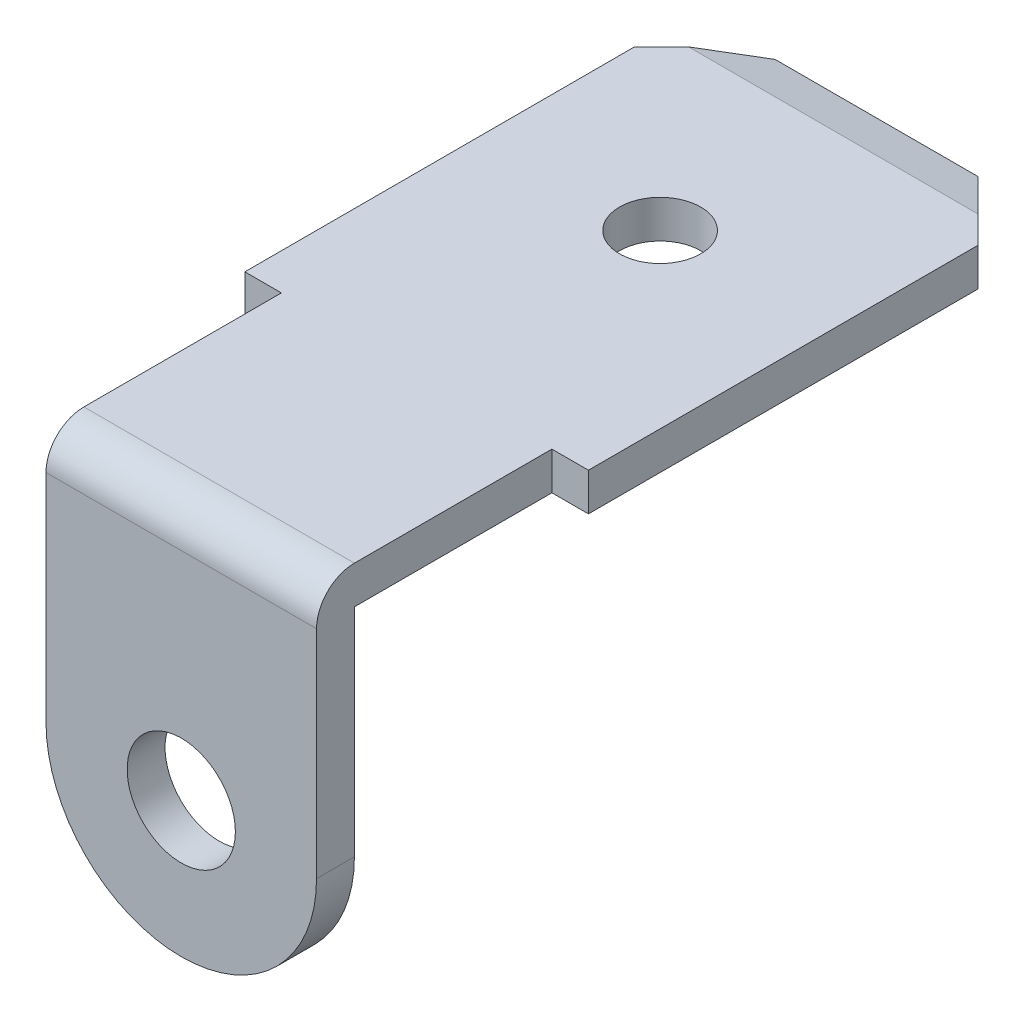
ISO-10303-21;
HEADER;
FILE_DESCRIPTION(('STEP AP214'),'2;1');
FILE_NAME('part.step','',(''),(''),'','','');
FILE_SCHEMA(('AUTOMOTIVE_DESIGN { 1 0 10303 214 1 1 1 1 }'));
ENDSEC;
DATA;
#1=APPLICATION_CONTEXT('core data for automotive mechanical design processes');
#2=APPLICATION_PROTOCOL_DEFINITION('international standard','automotive_design',2000,#1);
#3=PRODUCT_CONTEXT('',#1,'mechanical');
#4=PRODUCT('Part','Part','',(#3));
#5=PRODUCT_RELATED_PRODUCT_CATEGORY('part','',(#4));
#6=PRODUCT_DEFINITION_FORMATION('','',#4);
#7=PRODUCT_DEFINITION_CONTEXT('part definition',#1,'design');
#8=PRODUCT_DEFINITION('design','',#6,#7);
#9=PRODUCT_DEFINITION_SHAPE('','',#8);
#10=(LENGTH_UNIT() NAMED_UNIT(*) SI_UNIT(.MILLI.,.METRE.));
#11=(NAMED_UNIT(*) PLANE_ANGLE_UNIT() SI_UNIT($,.RADIAN.));
#12=(NAMED_UNIT(*) SI_UNIT($,.STERADIAN.) SOLID_ANGLE_UNIT());
#13=UNCERTAINTY_MEASURE_WITH_UNIT(LENGTH_MEASURE(1.E-05),#10,'distance_accuracy_value','');
#14=(GEOMETRIC_REPRESENTATION_CONTEXT(3) GLOBAL_UNCERTAINTY_ASSIGNED_CONTEXT((#13)) GLOBAL_UNIT_ASSIGNED_CONTEXT((#10,
#11,#12)) REPRESENTATION_CONTEXT('',''));
#15=CARTESIAN_POINT('',(0.,0.,0.));
#16=DIRECTION('',(0.,0.,1.));
#17=DIRECTION('',(1.,0.,0.));
#18=AXIS2_PLACEMENT_3D('',#15,#16,#17);
#19=CARTESIAN_POINT('',(0.,0.,0.));
#20=DIRECTION('',(0.,0.,1.));
#21=DIRECTION('',(1.,0.,0.));
#22=AXIS2_PLACEMENT_3D('',#19,#20,#21);
#23=CYLINDRICAL_SURFACE('',#22,1.);
#24=CARTESIAN_POINT('',(0.,0.,0.));
#25=DIRECTION('',(0.,0.,1.));
#26=DIRECTION('',(1.,0.,0.));
#27=AXIS2_PLACEMENT_3D('',#24,#25,#26);
#28=CIRCLE('',#27,1.);
#29=CARTESIAN_POINT('',(1.,0.,0.));
#30=VERTEX_POINT('',#29);
#31=EDGE_CURVE('E187',#30,#30,#28,.T.);
#32=ORIENTED_EDGE('',*,*,#31,.T.);
#33=DIRECTION('',(0.,0.,-1.));
#34=VECTOR('',#33,1.);
#35=CARTESIAN_POINT('',(1.,0.,0.));
#36=LINE('',#35,#34);
#37=CARTESIAN_POINT('',(1.,0.,-0.7));
#38=VERTEX_POINT('',#37);
#39=EDGE_CURVE('E11',#30,#38,#36,.T.);
#40=ORIENTED_EDGE('',*,*,#39,.T.);
#41=CARTESIAN_POINT('',(0.,0.,-0.7));
#42=DIRECTION('',(0.,0.,1.));
#43=DIRECTION('',(1.,0.,0.));
#44=AXIS2_PLACEMENT_3D('',#41,#42,#43);
#45=CIRCLE('',#44,1.);
#46=EDGE_CURVE('E20',#38,#38,#45,.T.);
#47=ORIENTED_EDGE('',*,*,#46,.F.);
#48=ORIENTED_EDGE('',*,*,#39,.F.);
#49=EDGE_LOOP('',(#32,#40,#47,#48));
#50=FACE_BOUND('',#49,.T.);
#51=ADVANCED_FACE('F17',(#50),#23,.F.);
#52=CARTESIAN_POINT('',(0.,1.283011768991,-0.7));
#53=DIRECTION('',(0.,0.,1.));
#54=DIRECTION('',(1.,0.,0.));
#55=AXIS2_PLACEMENT_3D('',#52,#53,#54);
#56=PLANE('',#55);
#57=ORIENTED_EDGE('',*,*,#46,.T.);
#58=EDGE_LOOP('',(#57));
#59=FACE_BOUND('',#58,.T.);
#60=DIRECTION('',(-1.,0.,0.));
#61=VECTOR('',#60,1.);
#62=CARTESIAN_POINT('',(2.5,4.,-0.7));
#63=LINE('',#62,#61);
#64=CARTESIAN_POINT('',(2.5,4.,-0.7));
#65=VERTEX_POINT('',#64);
#66=CARTESIAN_POINT('',(-2.5,4.,-0.7));
#67=VERTEX_POINT('',#66);
#68=EDGE_CURVE('E181',#65,#67,#63,.T.);
#69=ORIENTED_EDGE('',*,*,#68,.F.);
#70=DIRECTION('',(0.,1.,0.));
#71=VECTOR('',#70,1.);
#72=CARTESIAN_POINT('',(2.5,0.,-0.7));
#73=LINE('',#72,#71);
#74=CARTESIAN_POINT('',(2.5,0.,-0.7));
#75=VERTEX_POINT('',#74);
#76=EDGE_CURVE('E246',#75,#65,#73,.T.);
#77=ORIENTED_EDGE('',*,*,#76,.F.);
#78=CARTESIAN_POINT('',(0.,0.,-0.7));
#79=DIRECTION('',(0.,0.,1.));
#80=DIRECTION('',(1.,0.,0.));
#81=AXIS2_PLACEMENT_3D('',#78,#79,#80);
#82=CIRCLE('',#81,2.5);
#83=CARTESIAN_POINT('',(-2.5,0.,-0.7));
#84=VERTEX_POINT('',#83);
#85=EDGE_CURVE('E189',#84,#75,#82,.T.);
#86=ORIENTED_EDGE('',*,*,#85,.F.);
#87=DIRECTION('',(0.,-1.,0.));
#88=VECTOR('',#87,1.);
#89=CARTESIAN_POINT('',(-2.5,4.7,-0.7));
#90=LINE('',#89,#88);
#91=EDGE_CURVE('E354',#67,#84,#90,.T.);
#92=ORIENTED_EDGE('',*,*,#91,.F.);
#93=EDGE_LOOP('',(#69,#77,#86,#92));
#94=FACE_BOUND('',#93,.T.);
#95=ADVANCED_FACE('F200',(#59,#94),#56,.F.);
#96=CARTESIAN_POINT('',(0.,0.,0.));
#97=DIRECTION('',(0.,0.,1.));
#98=DIRECTION('',(1.,0.,0.));
#99=AXIS2_PLACEMENT_3D('',#96,#97,#98);
#100=CYLINDRICAL_SURFACE('',#99,2.5);
#101=DIRECTION('',(0.,0.,-1.));
#102=VECTOR('',#101,1.);
#103=CARTESIAN_POINT('',(-2.5,0.,0.));
#104=LINE('',#103,#102);
#105=CARTESIAN_POINT('',(-2.5,0.,0.));
#106=VERTEX_POINT('',#105);
#107=EDGE_CURVE('E358',#106,#84,#104,.T.);
#108=ORIENTED_EDGE('',*,*,#107,.T.);
#109=ORIENTED_EDGE('',*,*,#85,.T.);
#110=DIRECTION('',(0.,0.,-1.));
#111=VECTOR('',#110,1.);
#112=CARTESIAN_POINT('',(2.5,0.,0.));
#113=LINE('',#112,#111);
#114=CARTESIAN_POINT('',(2.5,0.,0.));
#115=VERTEX_POINT('',#114);
#116=EDGE_CURVE('E219',#115,#75,#113,.T.);
#117=ORIENTED_EDGE('',*,*,#116,.F.);
#118=CARTESIAN_POINT('',(0.,0.,0.));
#119=DIRECTION('',(0.,0.,1.));
#120=DIRECTION('',(1.,0.,0.));
#121=AXIS2_PLACEMENT_3D('',#118,#119,#120);
#122=CIRCLE('',#121,2.5);
#123=EDGE_CURVE('E184',#106,#115,#122,.T.);
#124=ORIENTED_EDGE('',*,*,#123,.F.);
#125=EDGE_LOOP('',(#108,#109,#117,#124));
#126=FACE_BOUND('',#125,.T.);
#127=ADVANCED_FACE('F207',(#126),#100,.T.);
#128=CARTESIAN_POINT('',(0.,1.283011768991,0.));
#129=DIRECTION('',(0.,0.,1.));
#130=DIRECTION('',(1.,0.,0.));
#131=AXIS2_PLACEMENT_3D('',#128,#129,#130);
#132=PLANE('',#131);
#133=ORIENTED_EDGE('',*,*,#31,.F.);
#134=EDGE_LOOP('',(#133));
#135=FACE_BOUND('',#134,.T.);
#136=DIRECTION('',(0.,1.,0.));
#137=VECTOR('',#136,1.);
#138=CARTESIAN_POINT('',(2.5,0.,0.));
#139=LINE('',#138,#137);
#140=CARTESIAN_POINT('',(2.5,4.,0.));
#141=VERTEX_POINT('',#140);
#142=EDGE_CURVE('E210',#115,#141,#139,.T.);
#143=ORIENTED_EDGE('',*,*,#142,.T.);
#144=DIRECTION('',(1.,0.,0.));
#145=VECTOR('',#144,1.);
#146=CARTESIAN_POINT('',(-2.5,4.,0.));
#147=LINE('',#146,#145);
#148=CARTESIAN_POINT('',(-2.5,4.,0.));
#149=VERTEX_POINT('',#148);
#150=EDGE_CURVE('E214',#149,#141,#147,.T.);
#151=ORIENTED_EDGE('',*,*,#150,.F.);
#152=DIRECTION('',(0.,-1.,0.));
#153=VECTOR('',#152,1.);
#154=CARTESIAN_POINT('',(-2.5,4.7,0.));
#155=LINE('',#154,#153);
#156=EDGE_CURVE('E361',#149,#106,#155,.T.);
#157=ORIENTED_EDGE('',*,*,#156,.T.);
#158=ORIENTED_EDGE('',*,*,#123,.T.);
#159=EDGE_LOOP('',(#143,#151,#157,#158));
#160=FACE_BOUND('',#159,.T.);
#161=ADVANCED_FACE('F204',(#135,#160),#132,.T.);
#162=CARTESIAN_POINT('',(0.,4.,-6.852754078708));
#163=DIRECTION('',(0.,1.,0.));
#164=DIRECTION('',(0.,0.,-1.));
#165=AXIS2_PLACEMENT_3D('',#162,#163,#164);
#166=PLANE('',#165);
#167=CARTESIAN_POINT('',(0.,4.,-8.85));
#168=DIRECTION('',(0.,1.,0.));
#169=DIRECTION('',(-1.,0.,0.));
#170=AXIS2_PLACEMENT_3D('',#167,#168,#169);
#171=CIRCLE('',#170,0.75);
#172=CARTESIAN_POINT('',(-0.75,4.,-8.85));
#173=VERTEX_POINT('',#172);
#174=EDGE_CURVE('E161',#173,#173,#171,.T.);
#175=ORIENTED_EDGE('',*,*,#174,.T.);
#176=EDGE_LOOP('',(#175));
#177=FACE_BOUND('',#176,.T.);
#178=DIRECTION('',(1.,0.,0.));
#179=VECTOR('',#178,1.);
#180=CARTESIAN_POINT('',(-1.875,4.,-12.05));
#181=LINE('',#180,#179);
#182=CARTESIAN_POINT('',(-2.675,4.,-12.05));
#183=VERTEX_POINT('',#182);
#184=CARTESIAN_POINT('',(2.675,4.,-12.05));
#185=VERTEX_POINT('',#184);
#186=EDGE_CURVE('E173',#183,#185,#181,.T.);
#187=ORIENTED_EDGE('',*,*,#186,.T.);
#188=DIRECTION('',(-0.707106781186548,0.,-0.707106781186548));
#189=VECTOR('',#188,1.);
#190=CARTESIAN_POINT('',(3.175,4.,-11.55));
#191=LINE('',#190,#189);
#192=CARTESIAN_POINT('',(3.175,4.,-11.55));
#193=VERTEX_POINT('',#192);
#194=EDGE_CURVE('E328',#193,#185,#191,.T.);
#195=ORIENTED_EDGE('',*,*,#194,.F.);
#196=DIRECTION('',(0.,0.,1.));
#197=VECTOR('',#196,1.);
#198=CARTESIAN_POINT('',(3.175,4.,-11.55));
#199=LINE('',#198,#197);
#200=CARTESIAN_POINT('',(3.175,4.,-4.35));
#201=VERTEX_POINT('',#200);
#202=EDGE_CURVE('E347',#193,#201,#199,.T.);
#203=ORIENTED_EDGE('',*,*,#202,.T.);
#204=DIRECTION('',(-1.,0.,0.));
#205=VECTOR('',#204,1.);
#206=CARTESIAN_POINT('',(3.175,4.,-4.35));
#207=LINE('',#206,#205);
#208=CARTESIAN_POINT('',(2.5,4.,-4.35));
#209=VERTEX_POINT('',#208);
#210=EDGE_CURVE('E235',#201,#209,#207,.T.);
#211=ORIENTED_EDGE('',*,*,#210,.T.);
#212=DIRECTION('',(0.,0.,1.));
#213=VECTOR('',#212,1.);
#214=CARTESIAN_POINT('',(2.5,4.,-4.35));
#215=LINE('',#214,#213);
#216=EDGE_CURVE('E176',#209,#65,#215,.T.);
#217=ORIENTED_EDGE('',*,*,#216,.T.);
#218=ORIENTED_EDGE('',*,*,#68,.T.);
#219=DIRECTION('',(0.,0.,-1.));
#220=VECTOR('',#219,1.);
#221=CARTESIAN_POINT('',(-2.5,4.,-0.7));
#222=LINE('',#221,#220);
#223=CARTESIAN_POINT('',(-2.5,4.,-4.35));
#224=VERTEX_POINT('',#223);
#225=EDGE_CURVE('E351',#67,#224,#222,.T.);
#226=ORIENTED_EDGE('',*,*,#225,.T.);
#227=DIRECTION('',(-1.,0.,0.));
#228=VECTOR('',#227,1.);
#229=CARTESIAN_POINT('',(-2.5,4.,-4.35));
#230=LINE('',#229,#228);
#231=CARTESIAN_POINT('',(-3.175,4.,-4.35));
#232=VERTEX_POINT('',#231);
#233=EDGE_CURVE('E336',#224,#232,#230,.T.);
#234=ORIENTED_EDGE('',*,*,#233,.T.);
#235=DIRECTION('',(0.,0.,-1.));
#236=VECTOR('',#235,1.);
#237=CARTESIAN_POINT('',(-3.175,4.,-4.35));
#238=LINE('',#237,#236);
#239=CARTESIAN_POINT('',(-3.175,4.,-11.55));
#240=VERTEX_POINT('',#239);
#241=EDGE_CURVE('E319',#232,#240,#238,.T.);
#242=ORIENTED_EDGE('',*,*,#241,.T.);
#243=DIRECTION('',(0.707106781186548,0.,-0.707106781186548));
#244=VECTOR('',#243,1.);
#245=CARTESIAN_POINT('',(-3.175,4.,-11.55));
#246=LINE('',#245,#244);
#247=EDGE_CURVE('E259',#240,#183,#246,.T.);
#248=ORIENTED_EDGE('',*,*,#247,.T.);
#249=EDGE_LOOP('',(#187,#195,#203,#211,#217,#218,#226,#234,#242,#248));
#250=FACE_BOUND('',#249,.T.);
#251=ADVANCED_FACE('F162',(#177,#250),#166,.F.);
#252=CARTESIAN_POINT('',(-1.875,4.1,-12.45));
#253=DIRECTION('',(0.,-0.970142500145391,-0.242535625036098));
#254=DIRECTION('',(0.,0.242535625036098,-0.970142500145391));
#255=AXIS2_PLACEMENT_3D('',#252,#253,#254);
#256=PLANE('',#255);
#257=DIRECTION('',(1.,0.,0.));
#258=VECTOR('',#257,1.);
#259=CARTESIAN_POINT('',(-1.875,4.2,-12.85));
#260=LINE('',#259,#258);
#261=CARTESIAN_POINT('',(-1.875,4.2,-12.85));
#262=VERTEX_POINT('',#261);
#263=CARTESIAN_POINT('',(1.875,4.2,-12.85));
#264=VERTEX_POINT('',#263);
#265=EDGE_CURVE('E167',#262,#264,#260,.T.);
#266=ORIENTED_EDGE('',*,*,#265,.T.);
#267=DIRECTION('',(-0.696310623822761,0.17407765595594,-0.696310623822761));
#268=VECTOR('',#267,1.);
#269=CARTESIAN_POINT('',(1.668939393939,4.251515151515,-13.05606060606));
#270=LINE('',#269,#268);
#271=EDGE_CURVE('E332',#185,#264,#270,.T.);
#272=ORIENTED_EDGE('',*,*,#271,.F.);
#273=ORIENTED_EDGE('',*,*,#186,.F.);
#274=DIRECTION('',(0.696310623822761,0.17407765595594,-0.696310623822761));
#275=VECTOR('',#274,1.);
#276=CARTESIAN_POINT('',(-2.57803030303,4.024242424242,-12.14696969697));
#277=LINE('',#276,#275);
#278=EDGE_CURVE('E263',#183,#262,#277,.T.);
#279=ORIENTED_EDGE('',*,*,#278,.T.);
#280=EDGE_LOOP('',(#266,#272,#273,#279));
#281=FACE_BOUND('',#280,.T.);
#282=ADVANCED_FACE('F412',(#281),#256,.T.);
#283=CARTESIAN_POINT('',(-1.875,4.7,-12.85));
#284=DIRECTION('',(0.,0.,1.));
#285=DIRECTION('',(0.,-1.,0.));
#286=AXIS2_PLACEMENT_3D('',#283,#284,#285);
#287=PLANE('',#286);
#288=DIRECTION('',(1.,0.,0.));
#289=VECTOR('',#288,1.);
#290=CARTESIAN_POINT('',(-1.875,4.5,-12.85));
#291=LINE('',#290,#289);
#292=CARTESIAN_POINT('',(-1.875,4.5,-12.85));
#293=VERTEX_POINT('',#292);
#294=CARTESIAN_POINT('',(1.875,4.5,-12.85));
#295=VERTEX_POINT('',#294);
#296=EDGE_CURVE('E315',#293,#295,#291,.T.);
#297=ORIENTED_EDGE('',*,*,#296,.T.);
#298=DIRECTION('',(0.,-1.,0.));
#299=VECTOR('',#298,1.);
#300=CARTESIAN_POINT('',(1.875,4.7,-12.85));
#301=LINE('',#300,#299);
#302=EDGE_CURVE('E302',#295,#264,#301,.T.);
#303=ORIENTED_EDGE('',*,*,#302,.T.);
#304=ORIENTED_EDGE('',*,*,#265,.F.);
#305=DIRECTION('',(0.,-1.,0.));
#306=VECTOR('',#305,1.);
#307=CARTESIAN_POINT('',(-1.875,4.7,-12.85));
#308=LINE('',#307,#306);
#309=EDGE_CURVE('E288',#293,#262,#308,.T.);
#310=ORIENTED_EDGE('',*,*,#309,.F.);
#311=EDGE_LOOP('',(#297,#303,#304,#310));
#312=FACE_BOUND('',#311,.T.);
#313=ADVANCED_FACE('F415',(#312),#287,.F.);
#314=CARTESIAN_POINT('',(0.,4.7,-8.85));
#315=DIRECTION('',(0.,1.,0.));
#316=DIRECTION('',(-1.,0.,0.));
#317=AXIS2_PLACEMENT_3D('',#314,#315,#316);
#318=CYLINDRICAL_SURFACE('',#317,0.75);
#319=CARTESIAN_POINT('',(0.,4.7,-8.85));
#320=DIRECTION('',(0.,1.,0.));
#321=DIRECTION('',(-1.,0.,0.));
#322=AXIS2_PLACEMENT_3D('',#319,#320,#321);
#323=CIRCLE('',#322,0.75);
#324=CARTESIAN_POINT('',(-0.75,4.7,-8.85));
#325=VERTEX_POINT('',#324);
#326=EDGE_CURVE('E264',#325,#325,#323,.T.);
#327=ORIENTED_EDGE('',*,*,#326,.T.);
#328=DIRECTION('',(0.,-1.,0.));
#329=VECTOR('',#328,1.);
#330=CARTESIAN_POINT('',(-0.75,4.7,-8.85));
#331=LINE('',#330,#329);
#332=EDGE_CURVE('E168',#325,#173,#331,.T.);
#333=ORIENTED_EDGE('',*,*,#332,.T.);
#334=ORIENTED_EDGE('',*,*,#174,.F.);
#335=ORIENTED_EDGE('',*,*,#332,.F.);
#336=EDGE_LOOP('',(#327,#333,#334,#335));
#337=FACE_BOUND('',#336,.T.);
#338=ADVANCED_FACE('F483',(#337),#318,.F.);
#339=CARTESIAN_POINT('',(2.5,3.156629834254,-1.368370165746));
#340=DIRECTION('',(1.,0.,0.));
#341=DIRECTION('',(0.,1.,0.));
#342=AXIS2_PLACEMENT_3D('',#339,#340,#341);
#343=PLANE('',#342);
#344=DIRECTION('',(0.,0.,1.));
#345=VECTOR('',#344,1.);
#346=CARTESIAN_POINT('',(2.5,4.7,-4.35));
#347=LINE('',#346,#345);
#348=CARTESIAN_POINT('',(2.5,4.7,-4.35));
#349=VERTEX_POINT('',#348);
#350=CARTESIAN_POINT('',(2.5,4.7,-0.7));
#351=VERTEX_POINT('',#350);
#352=EDGE_CURVE('E225',#349,#351,#347,.T.);
#353=ORIENTED_EDGE('',*,*,#352,.T.);
#354=CARTESIAN_POINT('',(2.5,4.,-0.7));
#355=DIRECTION('',(-1.,0.,0.));
#356=DIRECTION('',(0.,0.,1.));
#357=AXIS2_PLACEMENT_3D('',#354,#355,#356);
#358=CIRCLE('',#357,0.7);
#359=EDGE_CURVE('E220',#141,#351,#358,.T.);
#360=ORIENTED_EDGE('',*,*,#359,.F.);
#361=ORIENTED_EDGE('',*,*,#142,.F.);
#362=ORIENTED_EDGE('',*,*,#116,.T.);
#363=ORIENTED_EDGE('',*,*,#76,.T.);
#364=ORIENTED_EDGE('',*,*,#216,.F.);
#365=DIRECTION('',(0.,-1.,0.));
#366=VECTOR('',#365,1.);
#367=CARTESIAN_POINT('',(2.5,4.7,-4.35));
#368=LINE('',#367,#366);
#369=EDGE_CURVE('E240',#349,#209,#368,.T.);
#370=ORIENTED_EDGE('',*,*,#369,.F.);
#371=EDGE_LOOP('',(#353,#360,#361,#362,#363,#364,#370));
#372=FACE_BOUND('',#371,.T.);
#373=ADVANCED_FACE('F223',(#372),#343,.T.);
#374=CARTESIAN_POINT('',(-2.5,4.,-0.7));
#375=DIRECTION('',(1.,0.,0.));
#376=DIRECTION('',(0.,0.,1.));
#377=AXIS2_PLACEMENT_3D('',#374,#375,#376);
#378=CYLINDRICAL_SURFACE('',#377,0.7);
#379=ORIENTED_EDGE('',*,*,#150,.T.);
#380=ORIENTED_EDGE('',*,*,#359,.T.);
#381=DIRECTION('',(1.,0.,0.));
#382=VECTOR('',#381,1.);
#383=CARTESIAN_POINT('',(-2.5,4.7,-0.7));
#384=LINE('',#383,#382);
#385=CARTESIAN_POINT('',(-2.5,4.7,-0.7));
#386=VERTEX_POINT('',#385);
#387=EDGE_CURVE('E282',#386,#351,#384,.T.);
#388=ORIENTED_EDGE('',*,*,#387,.F.);
#389=CARTESIAN_POINT('',(-2.5,4.,-0.7));
#390=DIRECTION('',(-1.,0.,0.));
#391=DIRECTION('',(0.,0.,1.));
#392=AXIS2_PLACEMENT_3D('',#389,#390,#391);
#393=CIRCLE('',#392,0.7);
#394=EDGE_CURVE('E232',#149,#386,#393,.T.);
#395=ORIENTED_EDGE('',*,*,#394,.F.);
#396=EDGE_LOOP('',(#379,#380,#388,#395));
#397=FACE_BOUND('',#396,.T.);
#398=ADVANCED_FACE('F231',(#397),#378,.T.);
#399=CARTESIAN_POINT('',(3.175,4.7,-4.35));
#400=DIRECTION('',(0.,0.,-1.));
#401=DIRECTION('',(0.,-1.,0.));
#402=AXIS2_PLACEMENT_3D('',#399,#400,#401);
#403=PLANE('',#402);
#404=DIRECTION('',(-1.,0.,0.));
#405=VECTOR('',#404,1.);
#406=CARTESIAN_POINT('',(3.175,4.7,-4.35));
#407=LINE('',#406,#405);
#408=CARTESIAN_POINT('',(3.175,4.7,-4.35));
#409=VERTEX_POINT('',#408);
#410=EDGE_CURVE('E291',#409,#349,#407,.T.);
#411=ORIENTED_EDGE('',*,*,#410,.T.);
#412=ORIENTED_EDGE('',*,*,#369,.T.);
#413=ORIENTED_EDGE('',*,*,#210,.F.);
#414=DIRECTION('',(0.,-1.,0.));
#415=VECTOR('',#414,1.);
#416=CARTESIAN_POINT('',(3.175,4.7,-4.35));
#417=LINE('',#416,#415);
#418=EDGE_CURVE('E343',#409,#201,#417,.T.);
#419=ORIENTED_EDGE('',*,*,#418,.F.);
#420=EDGE_LOOP('',(#411,#412,#413,#419));
#421=FACE_BOUND('',#420,.T.);
#422=ADVANCED_FACE('F369',(#421),#403,.F.);
#423=CARTESIAN_POINT('',(-2.5,3.156629834254,-1.368370165746));
#424=DIRECTION('',(-1.,0.,0.));
#425=DIRECTION('',(0.,0.,1.));
#426=AXIS2_PLACEMENT_3D('',#423,#424,#425);
#427=PLANE('',#426);
#428=DIRECTION('',(0.,0.,-1.));
#429=VECTOR('',#428,1.);
#430=CARTESIAN_POINT('',(-2.5,4.7,0.));
#431=LINE('',#430,#429);
#432=CARTESIAN_POINT('',(-2.5,4.7,-4.35));
#433=VERTEX_POINT('',#432);
#434=EDGE_CURVE('E277',#386,#433,#431,.T.);
#435=ORIENTED_EDGE('',*,*,#434,.T.);
#436=DIRECTION('',(0.,-1.,0.));
#437=VECTOR('',#436,1.);
#438=CARTESIAN_POINT('',(-2.5,4.7,-4.35));
#439=LINE('',#438,#437);
#440=EDGE_CURVE('E339',#433,#224,#439,.T.);
#441=ORIENTED_EDGE('',*,*,#440,.T.);
#442=ORIENTED_EDGE('',*,*,#225,.F.);
#443=ORIENTED_EDGE('',*,*,#91,.T.);
#444=ORIENTED_EDGE('',*,*,#107,.F.);
#445=ORIENTED_EDGE('',*,*,#156,.F.);
#446=ORIENTED_EDGE('',*,*,#394,.T.);
#447=EDGE_LOOP('',(#435,#441,#442,#443,#444,#445,#446));
#448=FACE_BOUND('',#447,.T.);
#449=ADVANCED_FACE('F421',(#448),#427,.T.);
#450=CARTESIAN_POINT('',(3.175,4.7,-11.55));
#451=DIRECTION('',(-1.,0.,0.));
#452=DIRECTION('',(0.,0.,1.));
#453=AXIS2_PLACEMENT_3D('',#450,#451,#452);
#454=PLANE('',#453);
#455=DIRECTION('',(0.,0.,1.));
#456=VECTOR('',#455,1.);
#457=CARTESIAN_POINT('',(3.175,4.7,-11.55));
#458=LINE('',#457,#456);
#459=CARTESIAN_POINT('',(3.175,4.7,-11.55));
#460=VERTEX_POINT('',#459);
#461=EDGE_CURVE('E295',#460,#409,#458,.T.);
#462=ORIENTED_EDGE('',*,*,#461,.T.);
#463=ORIENTED_EDGE('',*,*,#418,.T.);
#464=ORIENTED_EDGE('',*,*,#202,.F.);
#465=DIRECTION('',(0.,-1.,0.));
#466=VECTOR('',#465,1.);
#467=CARTESIAN_POINT('',(3.175,4.7,-11.55));
#468=LINE('',#467,#466);
#469=EDGE_CURVE('E306',#460,#193,#468,.T.);
#470=ORIENTED_EDGE('',*,*,#469,.F.);
#471=EDGE_LOOP('',(#462,#463,#464,#470));
#472=FACE_BOUND('',#471,.T.);
#473=ADVANCED_FACE('F374',(#472),#454,.F.);
#474=CARTESIAN_POINT('',(-2.5,4.7,-4.35));
#475=DIRECTION('',(0.,0.,-1.));
#476=DIRECTION('',(0.,-1.,0.));
#477=AXIS2_PLACEMENT_3D('',#474,#475,#476);
#478=PLANE('',#477);
#479=DIRECTION('',(-1.,0.,0.));
#480=VECTOR('',#479,1.);
#481=CARTESIAN_POINT('',(-2.5,4.7,-4.35));
#482=LINE('',#481,#480);
#483=CARTESIAN_POINT('',(-3.175,4.7,-4.35));
#484=VERTEX_POINT('',#483);
#485=EDGE_CURVE('E273',#433,#484,#482,.T.);
#486=ORIENTED_EDGE('',*,*,#485,.T.);
#487=DIRECTION('',(0.,-1.,0.));
#488=VECTOR('',#487,1.);
#489=CARTESIAN_POINT('',(-3.175,4.7,-4.35));
#490=LINE('',#489,#488);
#491=EDGE_CURVE('E307',#484,#232,#490,.T.);
#492=ORIENTED_EDGE('',*,*,#491,.T.);
#493=ORIENTED_EDGE('',*,*,#233,.F.);
#494=ORIENTED_EDGE('',*,*,#440,.F.);
#495=EDGE_LOOP('',(#486,#492,#493,#494));
#496=FACE_BOUND('',#495,.T.);
#497=ADVANCED_FACE('F533',(#496),#478,.F.);
#498=CARTESIAN_POINT('',(3.175,4.7,-11.55));
#499=DIRECTION('',(0.707106781186548,0.,-0.707106781186548));
#500=DIRECTION('',(0.,-1.,0.));
#501=AXIS2_PLACEMENT_3D('',#498,#499,#500);
#502=PLANE('',#501);
#503=ORIENTED_EDGE('',*,*,#302,.F.);
#504=DIRECTION('',(-0.696310623822761,-0.17407765595594,-0.696310623822761));
#505=VECTOR('',#504,1.);
#506=CARTESIAN_POINT('',(1.711363636364,4.459090909091,-13.01363636363));
#507=LINE('',#506,#505);
#508=CARTESIAN_POINT('',(2.675,4.7,-12.05));
#509=VERTEX_POINT('',#508);
#510=EDGE_CURVE('E311',#509,#295,#507,.T.);
#511=ORIENTED_EDGE('',*,*,#510,.F.);
#512=DIRECTION('',(-0.707106781186548,0.,-0.707106781186548));
#513=VECTOR('',#512,1.);
#514=CARTESIAN_POINT('',(3.175,4.7,-11.55));
#515=LINE('',#514,#513);
#516=EDGE_CURVE('E272',#460,#509,#515,.T.);
#517=ORIENTED_EDGE('',*,*,#516,.F.);
#518=ORIENTED_EDGE('',*,*,#469,.T.);
#519=ORIENTED_EDGE('',*,*,#194,.T.);
#520=ORIENTED_EDGE('',*,*,#271,.T.);
#521=EDGE_LOOP('',(#503,#511,#517,#518,#519,#520));
#522=FACE_BOUND('',#521,.T.);
#523=ADVANCED_FACE('F417',(#522),#502,.T.);
#524=CARTESIAN_POINT('',(-3.175,4.7,-4.35));
#525=DIRECTION('',(1.,0.,0.));
#526=DIRECTION('',(0.,1.,0.));
#527=AXIS2_PLACEMENT_3D('',#524,#525,#526);
#528=PLANE('',#527);
#529=DIRECTION('',(0.,0.,-1.));
#530=VECTOR('',#529,1.);
#531=CARTESIAN_POINT('',(-3.175,4.7,-4.35));
#532=LINE('',#531,#530);
#533=CARTESIAN_POINT('',(-3.175,4.7,-11.55));
#534=VERTEX_POINT('',#533);
#535=EDGE_CURVE('E257',#484,#534,#532,.T.);
#536=ORIENTED_EDGE('',*,*,#535,.T.);
#537=DIRECTION('',(0.,-1.,0.));
#538=VECTOR('',#537,1.);
#539=CARTESIAN_POINT('',(-3.175,4.7,-11.55));
#540=LINE('',#539,#538);
#541=EDGE_CURVE('E262',#534,#240,#540,.T.);
#542=ORIENTED_EDGE('',*,*,#541,.T.);
#543=ORIENTED_EDGE('',*,*,#241,.F.);
#544=ORIENTED_EDGE('',*,*,#491,.F.);
#545=EDGE_LOOP('',(#536,#542,#543,#544));
#546=FACE_BOUND('',#545,.T.);
#547=ADVANCED_FACE('F550',(#546),#528,.F.);
#548=CARTESIAN_POINT('',(-1.875,4.6,-12.45));
#549=DIRECTION('',(0.,-0.970142500145391,0.242535625036098));
#550=DIRECTION('',(-1.,0.,0.));
#551=AXIS2_PLACEMENT_3D('',#548,#549,#550);
#552=PLANE('',#551);
#553=DIRECTION('',(0.696310623822761,-0.17407765595594,-0.696310623822761));
#554=VECTOR('',#553,1.);
#555=CARTESIAN_POINT('',(-2.620454545455,4.686363636364,-12.10454545454));
#556=LINE('',#555,#554);
#557=CARTESIAN_POINT('',(-2.675,4.7,-12.05));
#558=VERTEX_POINT('',#557);
#559=EDGE_CURVE('E281',#558,#293,#556,.T.);
#560=ORIENTED_EDGE('',*,*,#559,.F.);
#561=DIRECTION('',(1.,0.,0.));
#562=VECTOR('',#561,1.);
#563=CARTESIAN_POINT('',(-1.875,4.7,-12.05));
#564=LINE('',#563,#562);
#565=EDGE_CURVE('E268',#558,#509,#564,.T.);
#566=ORIENTED_EDGE('',*,*,#565,.T.);
#567=ORIENTED_EDGE('',*,*,#510,.T.);
#568=ORIENTED_EDGE('',*,*,#296,.F.);
#569=EDGE_LOOP('',(#560,#566,#567,#568));
#570=FACE_BOUND('',#569,.T.);
#571=ADVANCED_FACE('F392',(#570),#552,.F.);
#572=CARTESIAN_POINT('',(-3.175,4.7,-11.55));
#573=DIRECTION('',(0.707106781186548,0.,0.707106781186548));
#574=DIRECTION('',(0.,-1.,0.));
#575=AXIS2_PLACEMENT_3D('',#572,#573,#574);
#576=PLANE('',#575);
#577=ORIENTED_EDGE('',*,*,#278,.F.);
#578=ORIENTED_EDGE('',*,*,#247,.F.);
#579=ORIENTED_EDGE('',*,*,#541,.F.);
#580=DIRECTION('',(0.707106781186548,0.,-0.707106781186548));
#581=VECTOR('',#580,1.);
#582=CARTESIAN_POINT('',(-3.175,4.7,-11.55));
#583=LINE('',#582,#581);
#584=EDGE_CURVE('E398',#534,#558,#583,.T.);
#585=ORIENTED_EDGE('',*,*,#584,.T.);
#586=ORIENTED_EDGE('',*,*,#559,.T.);
#587=ORIENTED_EDGE('',*,*,#309,.T.);
#588=EDGE_LOOP('',(#577,#578,#579,#585,#586,#587));
#589=FACE_BOUND('',#588,.T.);
#590=ADVANCED_FACE('F401',(#589),#576,.F.);
#591=CARTESIAN_POINT('',(0.,4.7,-6.299906067267));
#592=DIRECTION('',(0.,1.,0.));
#593=DIRECTION('',(0.,0.,-1.));
#594=AXIS2_PLACEMENT_3D('',#591,#592,#593);
#595=PLANE('',#594);
#596=ORIENTED_EDGE('',*,*,#326,.F.);
#597=EDGE_LOOP('',(#596));
#598=FACE_BOUND('',#597,.T.);
#599=ORIENTED_EDGE('',*,*,#584,.F.);
#600=ORIENTED_EDGE('',*,*,#535,.F.);
#601=ORIENTED_EDGE('',*,*,#485,.F.);
#602=ORIENTED_EDGE('',*,*,#434,.F.);
#603=ORIENTED_EDGE('',*,*,#387,.T.);
#604=ORIENTED_EDGE('',*,*,#352,.F.);
#605=ORIENTED_EDGE('',*,*,#410,.F.);
#606=ORIENTED_EDGE('',*,*,#461,.F.);
#607=ORIENTED_EDGE('',*,*,#516,.T.);
#608=ORIENTED_EDGE('',*,*,#565,.F.);
#609=EDGE_LOOP('',(#599,#600,#601,#602,#603,#604,#605,#606,#607,#608));
#610=FACE_BOUND('',#609,.T.);
#611=ADVANCED_FACE('F396',(#598,#610),#595,.T.);
#612=CLOSED_SHELL('',(#51,#95,#127,#161,#251,#282,#313,#338,#373,#398,#422,#449,#473,#497,#523,
#547,#571,#590,#611));
#613=MANIFOLD_SOLID_BREP('B1',#612);
#614=ADVANCED_BREP_SHAPE_REPRESENTATION('',(#18,#613),#14);
#615=SHAPE_DEFINITION_REPRESENTATION(#9,#614);
ENDSEC;
END-ISO-10303-21;
